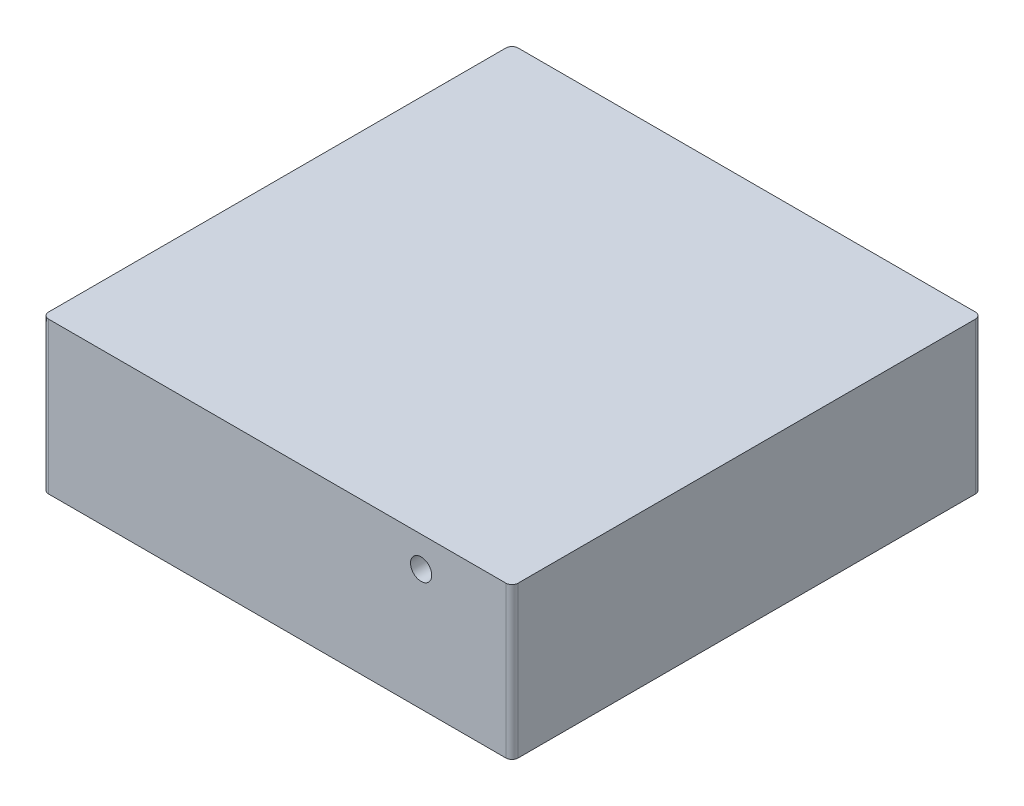
ISO-10303-21;
HEADER;
FILE_DESCRIPTION(('STEP AP214'),'2;1');
FILE_NAME('part.step','',(''),(''),'','','');
FILE_SCHEMA(('AUTOMOTIVE_DESIGN { 1 0 10303 214 1 1 1 1 }'));
ENDSEC;
DATA;
#1=APPLICATION_CONTEXT('core data for automotive mechanical design processes');
#2=APPLICATION_PROTOCOL_DEFINITION('international standard','automotive_design',2000,#1);
#3=PRODUCT_CONTEXT('',#1,'mechanical');
#4=PRODUCT('Part','Part','',(#3));
#5=PRODUCT_RELATED_PRODUCT_CATEGORY('part','',(#4));
#6=PRODUCT_DEFINITION_FORMATION('','',#4);
#7=PRODUCT_DEFINITION_CONTEXT('part definition',#1,'design');
#8=PRODUCT_DEFINITION('design','',#6,#7);
#9=PRODUCT_DEFINITION_SHAPE('','',#8);
#10=(LENGTH_UNIT() NAMED_UNIT(*) SI_UNIT(.MILLI.,.METRE.));
#11=(NAMED_UNIT(*) PLANE_ANGLE_UNIT() SI_UNIT($,.RADIAN.));
#12=(NAMED_UNIT(*) SI_UNIT($,.STERADIAN.) SOLID_ANGLE_UNIT());
#13=UNCERTAINTY_MEASURE_WITH_UNIT(LENGTH_MEASURE(1.E-05),#10,'distance_accuracy_value','');
#14=(GEOMETRIC_REPRESENTATION_CONTEXT(3) GLOBAL_UNCERTAINTY_ASSIGNED_CONTEXT((#13)) GLOBAL_UNIT_ASSIGNED_CONTEXT((#10,
#11,#12)) REPRESENTATION_CONTEXT('',''));
#15=CARTESIAN_POINT('',(0.,0.,0.));
#16=DIRECTION('',(0.,0.,1.));
#17=DIRECTION('',(1.,0.,0.));
#18=AXIS2_PLACEMENT_3D('',#15,#16,#17);
#19=CARTESIAN_POINT('',(10.5,23.,-67.));
#20=DIRECTION('',(0.,-1.,0.));
#21=DIRECTION('',(0.,0.,-1.));
#22=AXIS2_PLACEMENT_3D('',#19,#20,#21);
#23=CYLINDRICAL_SURFACE('',#22,1.);
#24=CARTESIAN_POINT('',(10.5,23.,-67.));
#25=DIRECTION('',(0.,1.,0.));
#26=DIRECTION('',(0.,0.,1.));
#27=AXIS2_PLACEMENT_3D('',#24,#25,#26);
#28=CIRCLE('',#27,1.);
#29=CARTESIAN_POINT('',(10.5,23.,-66.));
#30=VERTEX_POINT('',#29);
#31=EDGE_CURVE('E13',#30,#30,#28,.T.);
#32=ORIENTED_EDGE('',*,*,#31,.F.);
#33=EDGE_LOOP('',(#32));
#34=FACE_BOUND('',#33,.T.);
#35=CARTESIAN_POINT('',(10.5,2.,-67.));
#36=DIRECTION('',(0.,1.,0.));
#37=DIRECTION('',(0.,0.,1.));
#38=AXIS2_PLACEMENT_3D('',#35,#36,#37);
#39=CIRCLE('',#38,1.);
#40=CARTESIAN_POINT('',(10.5,2.,-66.));
#41=VERTEX_POINT('',#40);
#42=EDGE_CURVE('E57',#41,#41,#39,.T.);
#43=ORIENTED_EDGE('',*,*,#42,.T.);
#44=EDGE_LOOP('',(#43));
#45=FACE_BOUND('',#44,.T.);
#46=ADVANCED_FACE('F54',(#34,#45),#23,.T.);
#47=CARTESIAN_POINT('',(10.5,23.,-67.));
#48=DIRECTION('',(0.,1.,0.));
#49=DIRECTION('',(0.,0.,1.));
#50=AXIS2_PLACEMENT_3D('',#47,#48,#49);
#51=PLANE('',#50);
#52=ORIENTED_EDGE('',*,*,#31,.T.);
#53=EDGE_LOOP('',(#52));
#54=FACE_BOUND('',#53,.T.);
#55=ADVANCED_FACE('F69',(#54),#51,.T.);
#56=CARTESIAN_POINT('',(10.5,2.,-67.));
#57=DIRECTION('',(0.,1.,0.));
#58=DIRECTION('',(0.,0.,1.));
#59=AXIS2_PLACEMENT_3D('',#56,#57,#58);
#60=PLANE('',#59);
#61=ORIENTED_EDGE('',*,*,#42,.F.);
#62=EDGE_LOOP('',(#61));
#63=FACE_BOUND('',#62,.T.);
#64=ADVANCED_FACE('F67',(#63),#60,.F.);
#65=CLOSED_SHELL('',(#46,#55,#64));
#66=MANIFOLD_SOLID_BREP('B2',#65);
#67=CARTESIAN_POINT('',(67.,23.,-67.));
#68=DIRECTION('',(0.,-1.,0.));
#69=DIRECTION('',(0.,0.,-1.));
#70=AXIS2_PLACEMENT_3D('',#67,#68,#69);
#71=CYLINDRICAL_SURFACE('',#70,0.999999999999998);
#72=CARTESIAN_POINT('',(67.,23.,-67.));
#73=DIRECTION('',(0.,1.,0.));
#74=DIRECTION('',(0.,0.,1.));
#75=AXIS2_PLACEMENT_3D('',#72,#73,#74);
#76=CIRCLE('',#75,0.999999999999998);
#77=CARTESIAN_POINT('',(67.,23.,-66.));
#78=VERTEX_POINT('',#77);
#79=EDGE_CURVE('E53',#78,#78,#76,.T.);
#80=ORIENTED_EDGE('',*,*,#79,.F.);
#81=EDGE_LOOP('',(#80));
#82=FACE_BOUND('',#81,.T.);
#83=CARTESIAN_POINT('',(67.,2.,-67.));
#84=DIRECTION('',(0.,1.,0.));
#85=DIRECTION('',(0.,0.,1.));
#86=AXIS2_PLACEMENT_3D('',#83,#84,#85);
#87=CIRCLE('',#86,0.999999999999998);
#88=CARTESIAN_POINT('',(67.,2.,-66.));
#89=VERTEX_POINT('',#88);
#90=EDGE_CURVE('E114',#89,#89,#87,.T.);
#91=ORIENTED_EDGE('',*,*,#90,.T.);
#92=EDGE_LOOP('',(#91));
#93=FACE_BOUND('',#92,.T.);
#94=ADVANCED_FACE('F111',(#82,#93),#71,.T.);
#95=CARTESIAN_POINT('',(67.,23.,-67.));
#96=DIRECTION('',(0.,1.,0.));
#97=DIRECTION('',(0.,0.,1.));
#98=AXIS2_PLACEMENT_3D('',#95,#96,#97);
#99=PLANE('',#98);
#100=ORIENTED_EDGE('',*,*,#79,.T.);
#101=EDGE_LOOP('',(#100));
#102=FACE_BOUND('',#101,.T.);
#103=ADVANCED_FACE('F126',(#102),#99,.T.);
#104=CARTESIAN_POINT('',(67.,2.,-67.));
#105=DIRECTION('',(0.,1.,0.));
#106=DIRECTION('',(0.,0.,1.));
#107=AXIS2_PLACEMENT_3D('',#104,#105,#106);
#108=PLANE('',#107);
#109=ORIENTED_EDGE('',*,*,#90,.F.);
#110=EDGE_LOOP('',(#109));
#111=FACE_BOUND('',#110,.T.);
#112=ADVANCED_FACE('F124',(#111),#108,.F.);
#113=CLOSED_SHELL('',(#94,#103,#112));
#114=MANIFOLD_SOLID_BREP('B8',#113);
#115=CARTESIAN_POINT('',(67.,23.,-10.5));
#116=DIRECTION('',(0.,-1.,0.));
#117=DIRECTION('',(0.,0.,-1.));
#118=AXIS2_PLACEMENT_3D('',#115,#116,#117);
#119=CYLINDRICAL_SURFACE('',#118,0.999999999999998);
#120=CARTESIAN_POINT('',(67.,23.,-10.5));
#121=DIRECTION('',(0.,1.,0.));
#122=DIRECTION('',(0.,0.,1.));
#123=AXIS2_PLACEMENT_3D('',#120,#121,#122);
#124=CIRCLE('',#123,0.999999999999998);
#125=CARTESIAN_POINT('',(67.,23.,-9.50000000000001));
#126=VERTEX_POINT('',#125);
#127=EDGE_CURVE('E110',#126,#126,#124,.T.);
#128=ORIENTED_EDGE('',*,*,#127,.F.);
#129=EDGE_LOOP('',(#128));
#130=FACE_BOUND('',#129,.T.);
#131=CARTESIAN_POINT('',(67.,2.,-10.5));
#132=DIRECTION('',(0.,1.,0.));
#133=DIRECTION('',(0.,0.,1.));
#134=AXIS2_PLACEMENT_3D('',#131,#132,#133);
#135=CIRCLE('',#134,0.999999999999998);
#136=CARTESIAN_POINT('',(67.,2.,-9.50000000000001));
#137=VERTEX_POINT('',#136);
#138=EDGE_CURVE('E171',#137,#137,#135,.T.);
#139=ORIENTED_EDGE('',*,*,#138,.T.);
#140=EDGE_LOOP('',(#139));
#141=FACE_BOUND('',#140,.T.);
#142=ADVANCED_FACE('F168',(#130,#141),#119,.T.);
#143=CARTESIAN_POINT('',(67.,23.,-10.5));
#144=DIRECTION('',(0.,1.,0.));
#145=DIRECTION('',(0.,0.,1.));
#146=AXIS2_PLACEMENT_3D('',#143,#144,#145);
#147=PLANE('',#146);
#148=ORIENTED_EDGE('',*,*,#127,.T.);
#149=EDGE_LOOP('',(#148));
#150=FACE_BOUND('',#149,.T.);
#151=ADVANCED_FACE('F183',(#150),#147,.T.);
#152=CARTESIAN_POINT('',(67.,2.,-10.5));
#153=DIRECTION('',(0.,1.,0.));
#154=DIRECTION('',(0.,0.,1.));
#155=AXIS2_PLACEMENT_3D('',#152,#153,#154);
#156=PLANE('',#155);
#157=ORIENTED_EDGE('',*,*,#138,.F.);
#158=EDGE_LOOP('',(#157));
#159=FACE_BOUND('',#158,.T.);
#160=ADVANCED_FACE('F181',(#159),#156,.F.);
#161=CLOSED_SHELL('',(#142,#151,#160));
#162=MANIFOLD_SOLID_BREP('B48',#161);
#163=CARTESIAN_POINT('',(10.5,23.,-10.5));
#164=DIRECTION('',(0.,-1.,0.));
#165=DIRECTION('',(0.,0.,-1.));
#166=AXIS2_PLACEMENT_3D('',#163,#164,#165);
#167=CYLINDRICAL_SURFACE('',#166,1.);
#168=CARTESIAN_POINT('',(10.5,23.,-10.5));
#169=DIRECTION('',(0.,1.,0.));
#170=DIRECTION('',(0.,0.,1.));
#171=AXIS2_PLACEMENT_3D('',#168,#169,#170);
#172=CIRCLE('',#171,1.);
#173=CARTESIAN_POINT('',(10.5,23.,-9.49999999999999));
#174=VERTEX_POINT('',#173);
#175=EDGE_CURVE('E167',#174,#174,#172,.T.);
#176=ORIENTED_EDGE('',*,*,#175,.F.);
#177=EDGE_LOOP('',(#176));
#178=FACE_BOUND('',#177,.T.);
#179=CARTESIAN_POINT('',(10.5,2.,-10.5));
#180=DIRECTION('',(0.,1.,0.));
#181=DIRECTION('',(0.,0.,1.));
#182=AXIS2_PLACEMENT_3D('',#179,#180,#181);
#183=CIRCLE('',#182,1.);
#184=CARTESIAN_POINT('',(10.5,2.,-9.49999999999999));
#185=VERTEX_POINT('',#184);
#186=EDGE_CURVE('E229',#185,#185,#183,.T.);
#187=ORIENTED_EDGE('',*,*,#186,.T.);
#188=EDGE_LOOP('',(#187));
#189=FACE_BOUND('',#188,.T.);
#190=ADVANCED_FACE('F226',(#178,#189),#167,.T.);
#191=CARTESIAN_POINT('',(10.5,23.,-10.5));
#192=DIRECTION('',(0.,1.,0.));
#193=DIRECTION('',(0.,0.,1.));
#194=AXIS2_PLACEMENT_3D('',#191,#192,#193);
#195=PLANE('',#194);
#196=ORIENTED_EDGE('',*,*,#175,.T.);
#197=EDGE_LOOP('',(#196));
#198=FACE_BOUND('',#197,.T.);
#199=ADVANCED_FACE('F241',(#198),#195,.T.);
#200=CARTESIAN_POINT('',(10.5,2.,-10.5));
#201=DIRECTION('',(0.,1.,0.));
#202=DIRECTION('',(0.,0.,1.));
#203=AXIS2_PLACEMENT_3D('',#200,#201,#202);
#204=PLANE('',#203);
#205=ORIENTED_EDGE('',*,*,#186,.F.);
#206=EDGE_LOOP('',(#205));
#207=FACE_BOUND('',#206,.T.);
#208=ADVANCED_FACE('F239',(#207),#204,.F.);
#209=CLOSED_SHELL('',(#190,#199,#208));
#210=MANIFOLD_SOLID_BREP('B105',#209);
#211=CARTESIAN_POINT('',(1.,25.,-76.5));
#212=DIRECTION('',(0.,-1.,0.));
#213=DIRECTION('',(0.,0.,-1.));
#214=AXIS2_PLACEMENT_3D('',#211,#212,#213);
#215=CYLINDRICAL_SURFACE('',#214,1.);
#216=DIRECTION('',(0.,-1.,0.));
#217=VECTOR('',#216,1.);
#218=CARTESIAN_POINT('',(0.,25.,-76.5));
#219=LINE('',#218,#217);
#220=CARTESIAN_POINT('',(0.,25.,-76.5));
#221=VERTEX_POINT('',#220);
#222=CARTESIAN_POINT('',(0.,0.,-76.5));
#223=VERTEX_POINT('',#222);
#224=EDGE_CURVE('E567',#221,#223,#219,.T.);
#225=ORIENTED_EDGE('',*,*,#224,.F.);
#226=CARTESIAN_POINT('',(1.,25.,-76.5));
#227=DIRECTION('',(0.,-1.,0.));
#228=DIRECTION('',(0.,0.,-1.));
#229=AXIS2_PLACEMENT_3D('',#226,#227,#228);
#230=CIRCLE('',#229,1.);
#231=CARTESIAN_POINT('',(1.,25.,-77.5));
#232=VERTEX_POINT('',#231);
#233=EDGE_CURVE('E280',#232,#221,#230,.F.);
#234=ORIENTED_EDGE('',*,*,#233,.F.);
#235=DIRECTION('',(0.,-1.,0.));
#236=VECTOR('',#235,1.);
#237=CARTESIAN_POINT('',(1.,25.,-77.5));
#238=LINE('',#237,#236);
#239=CARTESIAN_POINT('',(1.,0.,-77.5));
#240=VERTEX_POINT('',#239);
#241=EDGE_CURVE('E570',#240,#232,#238,.F.);
#242=ORIENTED_EDGE('',*,*,#241,.F.);
#243=CARTESIAN_POINT('',(1.,0.,-76.5));
#244=DIRECTION('',(0.,-1.,0.));
#245=DIRECTION('',(0.,0.,-1.));
#246=AXIS2_PLACEMENT_3D('',#243,#244,#245);
#247=CIRCLE('',#246,1.);
#248=EDGE_CURVE('E224',#223,#240,#247,.T.);
#249=ORIENTED_EDGE('',*,*,#248,.F.);
#250=EDGE_LOOP('',(#225,#234,#242,#249));
#251=FACE_BOUND('',#250,.T.);
#252=ADVANCED_FACE('F273',(#251),#215,.T.);
#253=CARTESIAN_POINT('',(1.,25.,-1.));
#254=DIRECTION('',(0.,-1.,0.));
#255=DIRECTION('',(0.,0.,-1.));
#256=AXIS2_PLACEMENT_3D('',#253,#254,#255);
#257=CYLINDRICAL_SURFACE('',#256,1.);
#258=DIRECTION('',(0.,-1.,0.));
#259=VECTOR('',#258,1.);
#260=CARTESIAN_POINT('',(1.,25.,0.));
#261=LINE('',#260,#259);
#262=CARTESIAN_POINT('',(1.,25.,0.));
#263=VERTEX_POINT('',#262);
#264=CARTESIAN_POINT('',(1.,0.,0.));
#265=VERTEX_POINT('',#264);
#266=EDGE_CURVE('E556',#263,#265,#261,.T.);
#267=ORIENTED_EDGE('',*,*,#266,.F.);
#268=CARTESIAN_POINT('',(1.,25.,-1.));
#269=DIRECTION('',(0.,-1.,0.));
#270=DIRECTION('',(0.,0.,-1.));
#271=AXIS2_PLACEMENT_3D('',#268,#269,#270);
#272=CIRCLE('',#271,1.);
#273=CARTESIAN_POINT('',(0.,25.,-1.));
#274=VERTEX_POINT('',#273);
#275=EDGE_CURVE('E562',#274,#263,#272,.F.);
#276=ORIENTED_EDGE('',*,*,#275,.F.);
#277=DIRECTION('',(0.,-1.,0.));
#278=VECTOR('',#277,1.);
#279=CARTESIAN_POINT('',(0.,25.,-1.));
#280=LINE('',#279,#278);
#281=CARTESIAN_POINT('',(0.,0.,-1.));
#282=VERTEX_POINT('',#281);
#283=EDGE_CURVE('E559',#282,#274,#280,.F.);
#284=ORIENTED_EDGE('',*,*,#283,.F.);
#285=CARTESIAN_POINT('',(1.,0.,-1.));
#286=DIRECTION('',(0.,-1.,0.));
#287=DIRECTION('',(0.,0.,-1.));
#288=AXIS2_PLACEMENT_3D('',#285,#286,#287);
#289=CIRCLE('',#288,1.);
#290=EDGE_CURVE('E564',#265,#282,#289,.T.);
#291=ORIENTED_EDGE('',*,*,#290,.F.);
#292=EDGE_LOOP('',(#267,#276,#284,#291));
#293=FACE_BOUND('',#292,.T.);
#294=ADVANCED_FACE('F581',(#293),#257,.T.);
#295=CARTESIAN_POINT('',(76.5,25.,-1.));
#296=DIRECTION('',(0.,-1.,0.));
#297=DIRECTION('',(0.,0.,-1.));
#298=AXIS2_PLACEMENT_3D('',#295,#296,#297);
#299=CYLINDRICAL_SURFACE('',#298,1.);
#300=DIRECTION('',(0.,-1.,0.));
#301=VECTOR('',#300,1.);
#302=CARTESIAN_POINT('',(77.5,25.,-1.));
#303=LINE('',#302,#301);
#304=CARTESIAN_POINT('',(77.5,25.,-1.));
#305=VERTEX_POINT('',#304);
#306=CARTESIAN_POINT('',(77.5,0.,-1.));
#307=VERTEX_POINT('',#306);
#308=EDGE_CURVE('E545',#305,#307,#303,.T.);
#309=ORIENTED_EDGE('',*,*,#308,.F.);
#310=CARTESIAN_POINT('',(76.5,25.,-1.));
#311=DIRECTION('',(0.,-1.,0.));
#312=DIRECTION('',(0.,0.,-1.));
#313=AXIS2_PLACEMENT_3D('',#310,#311,#312);
#314=CIRCLE('',#313,1.);
#315=CARTESIAN_POINT('',(76.5,25.,0.));
#316=VERTEX_POINT('',#315);
#317=EDGE_CURVE('E551',#316,#305,#314,.F.);
#318=ORIENTED_EDGE('',*,*,#317,.F.);
#319=DIRECTION('',(0.,-1.,0.));
#320=VECTOR('',#319,1.);
#321=CARTESIAN_POINT('',(76.5,25.,0.));
#322=LINE('',#321,#320);
#323=CARTESIAN_POINT('',(76.5,0.,0.));
#324=VERTEX_POINT('',#323);
#325=EDGE_CURVE('E548',#324,#316,#322,.F.);
#326=ORIENTED_EDGE('',*,*,#325,.F.);
#327=CARTESIAN_POINT('',(76.5,0.,-1.));
#328=DIRECTION('',(0.,-1.,0.));
#329=DIRECTION('',(0.,0.,-1.));
#330=AXIS2_PLACEMENT_3D('',#327,#328,#329);
#331=CIRCLE('',#330,1.);
#332=EDGE_CURVE('E553',#307,#324,#331,.T.);
#333=ORIENTED_EDGE('',*,*,#332,.F.);
#334=EDGE_LOOP('',(#309,#318,#326,#333));
#335=FACE_BOUND('',#334,.T.);
#336=ADVANCED_FACE('F588',(#335),#299,.T.);
#337=CARTESIAN_POINT('',(76.5,25.,-76.5));
#338=DIRECTION('',(0.,-1.,0.));
#339=DIRECTION('',(0.,0.,-1.));
#340=AXIS2_PLACEMENT_3D('',#337,#338,#339);
#341=CYLINDRICAL_SURFACE('',#340,1.);
#342=DIRECTION('',(0.,-1.,0.));
#343=VECTOR('',#342,1.);
#344=CARTESIAN_POINT('',(76.5,25.,-77.5));
#345=LINE('',#344,#343);
#346=CARTESIAN_POINT('',(76.5,25.,-77.5));
#347=VERTEX_POINT('',#346);
#348=CARTESIAN_POINT('',(76.5,0.,-77.5));
#349=VERTEX_POINT('',#348);
#350=EDGE_CURVE('E524',#347,#349,#345,.T.);
#351=ORIENTED_EDGE('',*,*,#350,.F.);
#352=CARTESIAN_POINT('',(76.5,25.,-76.5));
#353=DIRECTION('',(0.,-1.,0.));
#354=DIRECTION('',(0.,0.,-1.));
#355=AXIS2_PLACEMENT_3D('',#352,#353,#354);
#356=CIRCLE('',#355,1.);
#357=CARTESIAN_POINT('',(77.5,25.,-76.5));
#358=VERTEX_POINT('',#357);
#359=EDGE_CURVE('E540',#358,#347,#356,.F.);
#360=ORIENTED_EDGE('',*,*,#359,.F.);
#361=DIRECTION('',(0.,-1.,0.));
#362=VECTOR('',#361,1.);
#363=CARTESIAN_POINT('',(77.5,25.,-76.5));
#364=LINE('',#363,#362);
#365=CARTESIAN_POINT('',(77.5,0.,-76.5));
#366=VERTEX_POINT('',#365);
#367=EDGE_CURVE('E537',#366,#358,#364,.F.);
#368=ORIENTED_EDGE('',*,*,#367,.F.);
#369=CARTESIAN_POINT('',(76.5,0.,-76.5));
#370=DIRECTION('',(0.,-1.,0.));
#371=DIRECTION('',(0.,0.,-1.));
#372=AXIS2_PLACEMENT_3D('',#369,#370,#371);
#373=CIRCLE('',#372,1.);
#374=EDGE_CURVE('E542',#349,#366,#373,.T.);
#375=ORIENTED_EDGE('',*,*,#374,.F.);
#376=EDGE_LOOP('',(#351,#360,#368,#375));
#377=FACE_BOUND('',#376,.T.);
#378=ADVANCED_FACE('F601',(#377),#341,.T.);
#379=CARTESIAN_POINT('',(0.,0.,0.));
#380=DIRECTION('',(0.,-1.,0.));
#381=DIRECTION('',(0.,0.,-1.));
#382=AXIS2_PLACEMENT_3D('',#379,#380,#381);
#383=PLANE('',#382);
#384=DIRECTION('',(0.,0.,1.));
#385=VECTOR('',#384,1.);
#386=CARTESIAN_POINT('',(0.,0.,0.));
#387=LINE('',#386,#385);
#388=EDGE_CURVE('E513',#223,#282,#387,.T.);
#389=ORIENTED_EDGE('',*,*,#388,.F.);
#390=ORIENTED_EDGE('',*,*,#248,.T.);
#391=DIRECTION('',(-1.,0.,0.));
#392=VECTOR('',#391,1.);
#393=CARTESIAN_POINT('',(0.,0.,-77.5));
#394=LINE('',#393,#392);
#395=EDGE_CURVE('E517',#349,#240,#394,.T.);
#396=ORIENTED_EDGE('',*,*,#395,.F.);
#397=ORIENTED_EDGE('',*,*,#374,.T.);
#398=DIRECTION('',(0.,0.,-1.));
#399=VECTOR('',#398,1.);
#400=CARTESIAN_POINT('',(77.5,0.,0.));
#401=LINE('',#400,#399);
#402=EDGE_CURVE('E528',#307,#366,#401,.T.);
#403=ORIENTED_EDGE('',*,*,#402,.F.);
#404=ORIENTED_EDGE('',*,*,#332,.T.);
#405=DIRECTION('',(1.,0.,0.));
#406=VECTOR('',#405,1.);
#407=CARTESIAN_POINT('',(0.,0.,0.));
#408=LINE('',#407,#406);
#409=EDGE_CURVE('E526',#265,#324,#408,.T.);
#410=ORIENTED_EDGE('',*,*,#409,.F.);
#411=ORIENTED_EDGE('',*,*,#290,.T.);
#412=EDGE_LOOP('',(#389,#390,#396,#397,#403,#404,#410,#411));
#413=FACE_BOUND('',#412,.T.);
#414=DIRECTION('',(-1.,0.,0.));
#415=VECTOR('',#414,1.);
#416=CARTESIAN_POINT('',(1.,0.,-76.5));
#417=LINE('',#416,#415);
#418=CARTESIAN_POINT('',(76.5,0.,-76.5));
#419=VERTEX_POINT('',#418);
#420=CARTESIAN_POINT('',(1.,0.,-76.5));
#421=VERTEX_POINT('',#420);
#422=EDGE_CURVE('E456',#419,#421,#417,.T.);
#423=ORIENTED_EDGE('',*,*,#422,.T.);
#424=DIRECTION('',(0.,0.,1.));
#425=VECTOR('',#424,1.);
#426=CARTESIAN_POINT('',(1.,0.,-1.));
#427=LINE('',#426,#425);
#428=CARTESIAN_POINT('',(1.,0.,-1.));
#429=VERTEX_POINT('',#428);
#430=EDGE_CURVE('E427',#421,#429,#427,.T.);
#431=ORIENTED_EDGE('',*,*,#430,.T.);
#432=DIRECTION('',(1.,0.,0.));
#433=VECTOR('',#432,1.);
#434=CARTESIAN_POINT('',(1.,0.,-1.));
#435=LINE('',#434,#433);
#436=CARTESIAN_POINT('',(76.5,0.,-1.));
#437=VERTEX_POINT('',#436);
#438=EDGE_CURVE('E465',#429,#437,#435,.T.);
#439=ORIENTED_EDGE('',*,*,#438,.T.);
#440=DIRECTION('',(0.,0.,-1.));
#441=VECTOR('',#440,1.);
#442=CARTESIAN_POINT('',(76.5,0.,-1.));
#443=LINE('',#442,#441);
#444=EDGE_CURVE('E468',#437,#419,#443,.T.);
#445=ORIENTED_EDGE('',*,*,#444,.T.);
#446=EDGE_LOOP('',(#423,#431,#439,#445));
#447=FACE_BOUND('',#446,.T.);
#448=ADVANCED_FACE('F593',(#413,#447),#383,.T.);
#449=CARTESIAN_POINT('',(0.,25.,0.));
#450=DIRECTION('',(1.,0.,0.));
#451=DIRECTION('',(0.,0.,-1.));
#452=AXIS2_PLACEMENT_3D('',#449,#450,#451);
#453=PLANE('',#452);
#454=CARTESIAN_POINT('',(0.,20.,-62.5));
#455=DIRECTION('',(1.,0.,0.));
#456=DIRECTION('',(0.,0.,-1.));
#457=AXIS2_PLACEMENT_3D('',#454,#455,#456);
#458=CIRCLE('',#457,2.);
#459=CARTESIAN_POINT('',(0.,20.,-64.5));
#460=VERTEX_POINT('',#459);
#461=EDGE_CURVE('E636',#460,#460,#458,.T.);
#462=ORIENTED_EDGE('',*,*,#461,.T.);
#463=EDGE_LOOP('',(#462));
#464=FACE_BOUND('',#463,.T.);
#465=DIRECTION('',(0.,0.,1.));
#466=VECTOR('',#465,1.);
#467=CARTESIAN_POINT('',(0.,25.,0.));
#468=LINE('',#467,#466);
#469=EDGE_CURVE('E514',#221,#274,#468,.T.);
#470=ORIENTED_EDGE('',*,*,#469,.F.);
#471=ORIENTED_EDGE('',*,*,#224,.T.);
#472=ORIENTED_EDGE('',*,*,#388,.T.);
#473=ORIENTED_EDGE('',*,*,#283,.T.);
#474=EDGE_LOOP('',(#470,#471,#472,#473));
#475=FACE_BOUND('',#474,.T.);
#476=ADVANCED_FACE('F577',(#464,#475),#453,.F.);
#477=CARTESIAN_POINT('',(0.,25.,0.));
#478=DIRECTION('',(0.,0.,-1.));
#479=DIRECTION('',(-1.,0.,0.));
#480=AXIS2_PLACEMENT_3D('',#477,#478,#479);
#481=PLANE('',#480);
#482=CARTESIAN_POINT('',(62.5,20.,0.));
#483=DIRECTION('',(0.,0.,1.));
#484=DIRECTION('',(1.,0.,0.));
#485=AXIS2_PLACEMENT_3D('',#482,#483,#484);
#486=CIRCLE('',#485,1.75);
#487=CARTESIAN_POINT('',(64.25,20.,0.));
#488=VERTEX_POINT('',#487);
#489=EDGE_CURVE('E534',#488,#488,#486,.T.);
#490=ORIENTED_EDGE('',*,*,#489,.F.);
#491=EDGE_LOOP('',(#490));
#492=FACE_BOUND('',#491,.T.);
#493=DIRECTION('',(1.,0.,0.));
#494=VECTOR('',#493,1.);
#495=CARTESIAN_POINT('',(0.,25.,0.));
#496=LINE('',#495,#494);
#497=EDGE_CURVE('E516',#263,#316,#496,.T.);
#498=ORIENTED_EDGE('',*,*,#497,.F.);
#499=ORIENTED_EDGE('',*,*,#266,.T.);
#500=ORIENTED_EDGE('',*,*,#409,.T.);
#501=ORIENTED_EDGE('',*,*,#325,.T.);
#502=EDGE_LOOP('',(#498,#499,#500,#501));
#503=FACE_BOUND('',#502,.T.);
#504=ADVANCED_FACE('F590',(#492,#503),#481,.F.);
#505=CARTESIAN_POINT('',(77.5,25.,0.));
#506=DIRECTION('',(-1.,0.,0.));
#507=DIRECTION('',(0.,0.,1.));
#508=AXIS2_PLACEMENT_3D('',#505,#506,#507);
#509=PLANE('',#508);
#510=DIRECTION('',(0.,0.,-1.));
#511=VECTOR('',#510,1.);
#512=CARTESIAN_POINT('',(77.5,25.,0.));
#513=LINE('',#512,#511);
#514=EDGE_CURVE('E519',#305,#358,#513,.T.);
#515=ORIENTED_EDGE('',*,*,#514,.F.);
#516=ORIENTED_EDGE('',*,*,#308,.T.);
#517=ORIENTED_EDGE('',*,*,#402,.T.);
#518=ORIENTED_EDGE('',*,*,#367,.T.);
#519=EDGE_LOOP('',(#515,#516,#517,#518));
#520=FACE_BOUND('',#519,.T.);
#521=ADVANCED_FACE('F596',(#520),#509,.F.);
#522=CARTESIAN_POINT('',(0.,25.,-77.5));
#523=DIRECTION('',(0.,0.,1.));
#524=DIRECTION('',(1.,0.,0.));
#525=AXIS2_PLACEMENT_3D('',#522,#523,#524);
#526=PLANE('',#525);
#527=ORIENTED_EDGE('',*,*,#395,.T.);
#528=ORIENTED_EDGE('',*,*,#241,.T.);
#529=DIRECTION('',(-1.,0.,0.));
#530=VECTOR('',#529,1.);
#531=CARTESIAN_POINT('',(0.,25.,-77.5));
#532=LINE('',#531,#530);
#533=EDGE_CURVE('E521',#347,#232,#532,.T.);
#534=ORIENTED_EDGE('',*,*,#533,.F.);
#535=ORIENTED_EDGE('',*,*,#350,.T.);
#536=EDGE_LOOP('',(#527,#528,#534,#535));
#537=FACE_BOUND('',#536,.T.);
#538=ADVANCED_FACE('F603',(#537),#526,.F.);
#539=CARTESIAN_POINT('',(0.,25.,0.));
#540=DIRECTION('',(0.,-1.,0.));
#541=DIRECTION('',(0.,0.,-1.));
#542=AXIS2_PLACEMENT_3D('',#539,#540,#541);
#543=PLANE('',#542);
#544=ORIENTED_EDGE('',*,*,#533,.T.);
#545=ORIENTED_EDGE('',*,*,#233,.T.);
#546=ORIENTED_EDGE('',*,*,#469,.T.);
#547=ORIENTED_EDGE('',*,*,#275,.T.);
#548=ORIENTED_EDGE('',*,*,#497,.T.);
#549=ORIENTED_EDGE('',*,*,#317,.T.);
#550=ORIENTED_EDGE('',*,*,#514,.T.);
#551=ORIENTED_EDGE('',*,*,#359,.T.);
#552=EDGE_LOOP('',(#544,#545,#546,#547,#548,#549,#550,#551));
#553=FACE_BOUND('',#552,.T.);
#554=ADVANCED_FACE('F572',(#553),#543,.F.);
#555=CARTESIAN_POINT('',(0.,3.99999999999999,0.));
#556=DIRECTION('',(0.,-1.,0.));
#557=DIRECTION('',(0.,0.,-1.));
#558=AXIS2_PLACEMENT_3D('',#555,#556,#557);
#559=PLANE('',#558);
#560=DIRECTION('',(0.,0.,1.));
#561=VECTOR('',#560,1.);
#562=CARTESIAN_POINT('',(1.,3.99999999999999,-1.));
#563=LINE('',#562,#561);
#564=CARTESIAN_POINT('',(1.,3.99999999999999,-76.5));
#565=VERTEX_POINT('',#564);
#566=CARTESIAN_POINT('',(1.,3.99999999999999,-1.));
#567=VERTEX_POINT('',#566);
#568=EDGE_CURVE('E452',#565,#567,#563,.T.);
#569=ORIENTED_EDGE('',*,*,#568,.F.);
#570=DIRECTION('',(-1.,0.,0.));
#571=VECTOR('',#570,1.);
#572=CARTESIAN_POINT('',(1.,3.99999999999999,-76.5));
#573=LINE('',#572,#571);
#574=CARTESIAN_POINT('',(76.5,3.99999999999999,-76.5));
#575=VERTEX_POINT('',#574);
#576=EDGE_CURVE('E460',#575,#565,#573,.T.);
#577=ORIENTED_EDGE('',*,*,#576,.F.);
#578=DIRECTION('',(0.,0.,-1.));
#579=VECTOR('',#578,1.);
#580=CARTESIAN_POINT('',(76.5,3.99999999999999,-1.));
#581=LINE('',#580,#579);
#582=CARTESIAN_POINT('',(76.5,3.99999999999999,-1.));
#583=VERTEX_POINT('',#582);
#584=EDGE_CURVE('E458',#583,#575,#581,.T.);
#585=ORIENTED_EDGE('',*,*,#584,.F.);
#586=DIRECTION('',(1.,0.,0.));
#587=VECTOR('',#586,1.);
#588=CARTESIAN_POINT('',(1.,3.99999999999999,-1.));
#589=LINE('',#588,#587);
#590=EDGE_CURVE('E455',#567,#583,#589,.T.);
#591=ORIENTED_EDGE('',*,*,#590,.F.);
#592=EDGE_LOOP('',(#569,#577,#585,#591));
#593=FACE_BOUND('',#592,.T.);
#594=DIRECTION('',(0.,0.,1.));
#595=VECTOR('',#594,1.);
#596=CARTESIAN_POINT('',(2.5,3.99999999999999,-2.5));
#597=LINE('',#596,#595);
#598=CARTESIAN_POINT('',(2.5,3.99999999999999,-75.));
#599=VERTEX_POINT('',#598);
#600=CARTESIAN_POINT('',(2.5,3.99999999999999,-2.5));
#601=VERTEX_POINT('',#600);
#602=EDGE_CURVE('E406',#599,#601,#597,.T.);
#603=ORIENTED_EDGE('',*,*,#602,.T.);
#604=DIRECTION('',(1.,0.,0.));
#605=VECTOR('',#604,1.);
#606=CARTESIAN_POINT('',(2.5,3.99999999999999,-2.5));
#607=LINE('',#606,#605);
#608=CARTESIAN_POINT('',(75.,3.99999999999999,-2.5));
#609=VERTEX_POINT('',#608);
#610=EDGE_CURVE('E411',#601,#609,#607,.T.);
#611=ORIENTED_EDGE('',*,*,#610,.T.);
#612=DIRECTION('',(0.,0.,-1.));
#613=VECTOR('',#612,1.);
#614=CARTESIAN_POINT('',(75.,3.99999999999999,-2.5));
#615=LINE('',#614,#613);
#616=CARTESIAN_POINT('',(75.,3.99999999999999,-75.));
#617=VERTEX_POINT('',#616);
#618=EDGE_CURVE('E432',#609,#617,#615,.T.);
#619=ORIENTED_EDGE('',*,*,#618,.T.);
#620=DIRECTION('',(-1.,0.,0.));
#621=VECTOR('',#620,1.);
#622=CARTESIAN_POINT('',(2.5,3.99999999999999,-75.));
#623=LINE('',#622,#621);
#624=EDGE_CURVE('E414',#617,#599,#623,.T.);
#625=ORIENTED_EDGE('',*,*,#624,.T.);
#626=EDGE_LOOP('',(#603,#611,#619,#625));
#627=FACE_BOUND('',#626,.T.);
#628=ADVANCED_FACE('F408',(#593,#627),#559,.T.);
#629=CARTESIAN_POINT('',(1.,3.99999999999999,-1.));
#630=DIRECTION('',(1.,0.,0.));
#631=DIRECTION('',(0.,0.,-1.));
#632=AXIS2_PLACEMENT_3D('',#629,#630,#631);
#633=PLANE('',#632);
#634=ORIENTED_EDGE('',*,*,#430,.F.);
#635=DIRECTION('',(0.,-1.,0.));
#636=VECTOR('',#635,1.);
#637=CARTESIAN_POINT('',(1.,3.99999999999999,-76.5));
#638=LINE('',#637,#636);
#639=EDGE_CURVE('E462',#565,#421,#638,.T.);
#640=ORIENTED_EDGE('',*,*,#639,.F.);
#641=ORIENTED_EDGE('',*,*,#568,.T.);
#642=DIRECTION('',(0.,-1.,0.));
#643=VECTOR('',#642,1.);
#644=CARTESIAN_POINT('',(1.,3.99999999999999,-1.));
#645=LINE('',#644,#643);
#646=EDGE_CURVE('E479',#567,#429,#645,.T.);
#647=ORIENTED_EDGE('',*,*,#646,.T.);
#648=EDGE_LOOP('',(#634,#640,#641,#647));
#649=FACE_BOUND('',#648,.T.);
#650=ADVANCED_FACE('F670',(#649),#633,.T.);
#651=CARTESIAN_POINT('',(1.,3.99999999999999,-1.));
#652=DIRECTION('',(0.,0.,-1.));
#653=DIRECTION('',(-1.,0.,0.));
#654=AXIS2_PLACEMENT_3D('',#651,#652,#653);
#655=PLANE('',#654);
#656=ORIENTED_EDGE('',*,*,#438,.F.);
#657=ORIENTED_EDGE('',*,*,#646,.F.);
#658=ORIENTED_EDGE('',*,*,#590,.T.);
#659=DIRECTION('',(0.,-1.,0.));
#660=VECTOR('',#659,1.);
#661=CARTESIAN_POINT('',(76.5,3.99999999999999,-1.));
#662=LINE('',#661,#660);
#663=EDGE_CURVE('E477',#583,#437,#662,.T.);
#664=ORIENTED_EDGE('',*,*,#663,.T.);
#665=EDGE_LOOP('',(#656,#657,#658,#664));
#666=FACE_BOUND('',#665,.T.);
#667=ADVANCED_FACE('F678',(#666),#655,.T.);
#668=CARTESIAN_POINT('',(76.5,3.99999999999999,-1.));
#669=DIRECTION('',(-1.,0.,0.));
#670=DIRECTION('',(0.,0.,1.));
#671=AXIS2_PLACEMENT_3D('',#668,#669,#670);
#672=PLANE('',#671);
#673=ORIENTED_EDGE('',*,*,#444,.F.);
#674=ORIENTED_EDGE('',*,*,#663,.F.);
#675=ORIENTED_EDGE('',*,*,#584,.T.);
#676=DIRECTION('',(0.,-1.,0.));
#677=VECTOR('',#676,1.);
#678=CARTESIAN_POINT('',(76.5,3.99999999999999,-76.5));
#679=LINE('',#678,#677);
#680=EDGE_CURVE('E475',#575,#419,#679,.T.);
#681=ORIENTED_EDGE('',*,*,#680,.T.);
#682=EDGE_LOOP('',(#673,#674,#675,#681));
#683=FACE_BOUND('',#682,.T.);
#684=ADVANCED_FACE('F674',(#683),#672,.T.);
#685=CARTESIAN_POINT('',(1.,3.99999999999999,-76.5));
#686=DIRECTION('',(0.,0.,1.));
#687=DIRECTION('',(1.,0.,0.));
#688=AXIS2_PLACEMENT_3D('',#685,#686,#687);
#689=PLANE('',#688);
#690=ORIENTED_EDGE('',*,*,#422,.F.);
#691=ORIENTED_EDGE('',*,*,#680,.F.);
#692=ORIENTED_EDGE('',*,*,#576,.T.);
#693=ORIENTED_EDGE('',*,*,#639,.T.);
#694=EDGE_LOOP('',(#690,#691,#692,#693));
#695=FACE_BOUND('',#694,.T.);
#696=ADVANCED_FACE('F667',(#695),#689,.T.);
#697=CARTESIAN_POINT('',(2.5,3.99999999999999,-2.5));
#698=DIRECTION('',(1.,0.,0.));
#699=DIRECTION('',(0.,0.,-1.));
#700=AXIS2_PLACEMENT_3D('',#697,#698,#699);
#701=PLANE('',#700);
#702=DIRECTION('',(0.,0.,1.));
#703=VECTOR('',#702,1.);
#704=CARTESIAN_POINT('',(2.5,0.,-2.5));
#705=LINE('',#704,#703);
#706=CARTESIAN_POINT('',(2.5,0.,-75.));
#707=VERTEX_POINT('',#706);
#708=CARTESIAN_POINT('',(2.5,0.,-2.5));
#709=VERTEX_POINT('',#708);
#710=EDGE_CURVE('E423',#707,#709,#705,.T.);
#711=ORIENTED_EDGE('',*,*,#710,.T.);
#712=DIRECTION('',(0.,-1.,0.));
#713=VECTOR('',#712,1.);
#714=CARTESIAN_POINT('',(2.5,3.99999999999999,-2.5));
#715=LINE('',#714,#713);
#716=EDGE_CURVE('E420',#601,#709,#715,.T.);
#717=ORIENTED_EDGE('',*,*,#716,.F.);
#718=ORIENTED_EDGE('',*,*,#602,.F.);
#719=DIRECTION('',(0.,-1.,0.));
#720=VECTOR('',#719,1.);
#721=CARTESIAN_POINT('',(2.5,3.99999999999999,-75.));
#722=LINE('',#721,#720);
#723=EDGE_CURVE('E438',#599,#707,#722,.T.);
#724=ORIENTED_EDGE('',*,*,#723,.T.);
#725=EDGE_LOOP('',(#711,#717,#718,#724));
#726=FACE_BOUND('',#725,.T.);
#727=ADVANCED_FACE('F421',(#726),#701,.F.);
#728=CARTESIAN_POINT('',(2.5,3.99999999999999,-2.5));
#729=DIRECTION('',(0.,0.,-1.));
#730=DIRECTION('',(-1.,0.,0.));
#731=AXIS2_PLACEMENT_3D('',#728,#729,#730);
#732=PLANE('',#731);
#733=DIRECTION('',(1.,0.,0.));
#734=VECTOR('',#733,1.);
#735=CARTESIAN_POINT('',(2.5,0.,-2.5));
#736=LINE('',#735,#734);
#737=CARTESIAN_POINT('',(75.,0.,-2.5));
#738=VERTEX_POINT('',#737);
#739=EDGE_CURVE('E440',#709,#738,#736,.T.);
#740=ORIENTED_EDGE('',*,*,#739,.T.);
#741=DIRECTION('',(0.,-1.,0.));
#742=VECTOR('',#741,1.);
#743=CARTESIAN_POINT('',(75.,3.99999999999999,-2.5));
#744=LINE('',#743,#742);
#745=EDGE_CURVE('E428',#609,#738,#744,.T.);
#746=ORIENTED_EDGE('',*,*,#745,.F.);
#747=ORIENTED_EDGE('',*,*,#610,.F.);
#748=ORIENTED_EDGE('',*,*,#716,.T.);
#749=EDGE_LOOP('',(#740,#746,#747,#748));
#750=FACE_BOUND('',#749,.T.);
#751=ADVANCED_FACE('F430',(#750),#732,.F.);
#752=CARTESIAN_POINT('',(75.,3.99999999999999,-2.5));
#753=DIRECTION('',(-1.,0.,0.));
#754=DIRECTION('',(0.,0.,1.));
#755=AXIS2_PLACEMENT_3D('',#752,#753,#754);
#756=PLANE('',#755);
#757=DIRECTION('',(0.,0.,-1.));
#758=VECTOR('',#757,1.);
#759=CARTESIAN_POINT('',(75.,0.,-2.5));
#760=LINE('',#759,#758);
#761=CARTESIAN_POINT('',(75.,0.,-75.));
#762=VERTEX_POINT('',#761);
#763=EDGE_CURVE('E443',#738,#762,#760,.T.);
#764=ORIENTED_EDGE('',*,*,#763,.T.);
#765=DIRECTION('',(0.,-1.,0.));
#766=VECTOR('',#765,1.);
#767=CARTESIAN_POINT('',(75.,3.99999999999999,-75.));
#768=LINE('',#767,#766);
#769=EDGE_CURVE('E448',#617,#762,#768,.T.);
#770=ORIENTED_EDGE('',*,*,#769,.F.);
#771=ORIENTED_EDGE('',*,*,#618,.F.);
#772=ORIENTED_EDGE('',*,*,#745,.T.);
#773=EDGE_LOOP('',(#764,#770,#771,#772));
#774=FACE_BOUND('',#773,.T.);
#775=ADVANCED_FACE('F658',(#774),#756,.F.);
#776=CARTESIAN_POINT('',(2.5,3.99999999999999,-75.));
#777=DIRECTION('',(0.,0.,1.));
#778=DIRECTION('',(1.,0.,0.));
#779=AXIS2_PLACEMENT_3D('',#776,#777,#778);
#780=PLANE('',#779);
#781=DIRECTION('',(-1.,0.,0.));
#782=VECTOR('',#781,1.);
#783=CARTESIAN_POINT('',(2.5,0.,-75.));
#784=LINE('',#783,#782);
#785=EDGE_CURVE('E417',#762,#707,#784,.T.);
#786=ORIENTED_EDGE('',*,*,#785,.T.);
#787=ORIENTED_EDGE('',*,*,#723,.F.);
#788=ORIENTED_EDGE('',*,*,#624,.F.);
#789=ORIENTED_EDGE('',*,*,#769,.T.);
#790=EDGE_LOOP('',(#786,#787,#788,#789));
#791=FACE_BOUND('',#790,.T.);
#792=ADVANCED_FACE('F654',(#791),#780,.F.);
#793=CARTESIAN_POINT('',(0.,23.,0.));
#794=DIRECTION('',(0.,-1.,0.));
#795=DIRECTION('',(0.,0.,-1.));
#796=AXIS2_PLACEMENT_3D('',#793,#794,#795);
#797=PLANE('',#796);
#798=DIRECTION('',(0.,0.,1.));
#799=VECTOR('',#798,1.);
#800=CARTESIAN_POINT('',(3.5,23.,-3.5));
#801=LINE('',#800,#799);
#802=CARTESIAN_POINT('',(3.5,23.,-74.));
#803=VERTEX_POINT('',#802);
#804=CARTESIAN_POINT('',(3.5,23.,-3.5));
#805=VERTEX_POINT('',#804);
#806=EDGE_CURVE('E483',#803,#805,#801,.T.);
#807=ORIENTED_EDGE('',*,*,#806,.F.);
#808=DIRECTION('',(-1.,0.,0.));
#809=VECTOR('',#808,1.);
#810=CARTESIAN_POINT('',(3.5,23.,-74.));
#811=LINE('',#810,#809);
#812=CARTESIAN_POINT('',(74.,23.,-74.));
#813=VERTEX_POINT('',#812);
#814=EDGE_CURVE('E491',#813,#803,#811,.T.);
#815=ORIENTED_EDGE('',*,*,#814,.F.);
#816=DIRECTION('',(0.,0.,-1.));
#817=VECTOR('',#816,1.);
#818=CARTESIAN_POINT('',(74.,23.,-3.5));
#819=LINE('',#818,#817);
#820=CARTESIAN_POINT('',(74.,23.,-3.5));
#821=VERTEX_POINT('',#820);
#822=EDGE_CURVE('E489',#821,#813,#819,.T.);
#823=ORIENTED_EDGE('',*,*,#822,.F.);
#824=DIRECTION('',(1.,0.,0.));
#825=VECTOR('',#824,1.);
#826=CARTESIAN_POINT('',(3.5,23.,-3.5));
#827=LINE('',#826,#825);
#828=EDGE_CURVE('E486',#805,#821,#827,.T.);
#829=ORIENTED_EDGE('',*,*,#828,.F.);
#830=EDGE_LOOP('',(#807,#815,#823,#829));
#831=FACE_BOUND('',#830,.T.);
#832=ADVANCED_FACE('F657',(#831),#797,.T.);
#833=CARTESIAN_POINT('',(74.,23.,-3.5));
#834=DIRECTION('',(-1.,0.,0.));
#835=DIRECTION('',(0.,0.,1.));
#836=AXIS2_PLACEMENT_3D('',#833,#834,#835);
#837=PLANE('',#836);
#838=DIRECTION('',(0.,0.,-1.));
#839=VECTOR('',#838,1.);
#840=CARTESIAN_POINT('',(74.,0.,-3.5));
#841=LINE('',#840,#839);
#842=CARTESIAN_POINT('',(74.,0.,-3.5));
#843=VERTEX_POINT('',#842);
#844=CARTESIAN_POINT('',(74.,0.,-74.));
#845=VERTEX_POINT('',#844);
#846=EDGE_CURVE('E499',#843,#845,#841,.T.);
#847=ORIENTED_EDGE('',*,*,#846,.F.);
#848=DIRECTION('',(0.,-1.,0.));
#849=VECTOR('',#848,1.);
#850=CARTESIAN_POINT('',(74.,23.,-3.5));
#851=LINE('',#850,#849);
#852=EDGE_CURVE('E508',#821,#843,#851,.T.);
#853=ORIENTED_EDGE('',*,*,#852,.F.);
#854=ORIENTED_EDGE('',*,*,#822,.T.);
#855=DIRECTION('',(0.,-1.,0.));
#856=VECTOR('',#855,1.);
#857=CARTESIAN_POINT('',(74.,23.,-74.));
#858=LINE('',#857,#856);
#859=EDGE_CURVE('E506',#813,#845,#858,.T.);
#860=ORIENTED_EDGE('',*,*,#859,.T.);
#861=EDGE_LOOP('',(#847,#853,#854,#860));
#862=FACE_BOUND('',#861,.T.);
#863=ADVANCED_FACE('F688',(#862),#837,.T.);
#864=CARTESIAN_POINT('',(3.5,23.,-3.5));
#865=DIRECTION('',(0.,0.,-1.));
#866=DIRECTION('',(-1.,0.,0.));
#867=AXIS2_PLACEMENT_3D('',#864,#865,#866);
#868=PLANE('',#867);
#869=CARTESIAN_POINT('',(62.5,20.,-3.5));
#870=DIRECTION('',(0.,0.,-1.));
#871=DIRECTION('',(-1.,0.,0.));
#872=AXIS2_PLACEMENT_3D('',#869,#870,#871);
#873=CIRCLE('',#872,1.75);
#874=CARTESIAN_POINT('',(60.75,20.,-3.5));
#875=VERTEX_POINT('',#874);
#876=EDGE_CURVE('E441',#875,#875,#873,.T.);
#877=ORIENTED_EDGE('',*,*,#876,.F.);
#878=EDGE_LOOP('',(#877));
#879=FACE_BOUND('',#878,.T.);
#880=DIRECTION('',(1.,0.,0.));
#881=VECTOR('',#880,1.);
#882=CARTESIAN_POINT('',(3.5,0.,-3.5));
#883=LINE('',#882,#881);
#884=CARTESIAN_POINT('',(3.5,0.,-3.5));
#885=VERTEX_POINT('',#884);
#886=EDGE_CURVE('E496',#885,#843,#883,.T.);
#887=ORIENTED_EDGE('',*,*,#886,.F.);
#888=DIRECTION('',(0.,-1.,0.));
#889=VECTOR('',#888,1.);
#890=CARTESIAN_POINT('',(3.5,23.,-3.5));
#891=LINE('',#890,#889);
#892=EDGE_CURVE('E510',#805,#885,#891,.T.);
#893=ORIENTED_EDGE('',*,*,#892,.F.);
#894=ORIENTED_EDGE('',*,*,#828,.T.);
#895=ORIENTED_EDGE('',*,*,#852,.T.);
#896=EDGE_LOOP('',(#887,#893,#894,#895));
#897=FACE_BOUND('',#896,.T.);
#898=ADVANCED_FACE('F697',(#879,#897),#868,.T.);
#899=CARTESIAN_POINT('',(3.5,23.,-3.5));
#900=DIRECTION('',(1.,0.,0.));
#901=DIRECTION('',(0.,0.,-1.));
#902=AXIS2_PLACEMENT_3D('',#899,#900,#901);
#903=PLANE('',#902);
#904=CARTESIAN_POINT('',(3.5,20.,-62.5));
#905=DIRECTION('',(1.,0.,0.));
#906=DIRECTION('',(0.,0.,-1.));
#907=AXIS2_PLACEMENT_3D('',#904,#905,#906);
#908=CIRCLE('',#907,2.);
#909=CARTESIAN_POINT('',(3.5,20.,-64.5));
#910=VERTEX_POINT('',#909);
#911=EDGE_CURVE('E634',#910,#910,#908,.T.);
#912=ORIENTED_EDGE('',*,*,#911,.F.);
#913=EDGE_LOOP('',(#912));
#914=FACE_BOUND('',#913,.T.);
#915=DIRECTION('',(0.,0.,1.));
#916=VECTOR('',#915,1.);
#917=CARTESIAN_POINT('',(3.5,0.,-3.5));
#918=LINE('',#917,#916);
#919=CARTESIAN_POINT('',(3.5,0.,-74.));
#920=VERTEX_POINT('',#919);
#921=EDGE_CURVE('E482',#920,#885,#918,.T.);
#922=ORIENTED_EDGE('',*,*,#921,.F.);
#923=DIRECTION('',(0.,-1.,0.));
#924=VECTOR('',#923,1.);
#925=CARTESIAN_POINT('',(3.5,23.,-74.));
#926=LINE('',#925,#924);
#927=EDGE_CURVE('E493',#803,#920,#926,.T.);
#928=ORIENTED_EDGE('',*,*,#927,.F.);
#929=ORIENTED_EDGE('',*,*,#806,.T.);
#930=ORIENTED_EDGE('',*,*,#892,.T.);
#931=EDGE_LOOP('',(#922,#928,#929,#930));
#932=FACE_BOUND('',#931,.T.);
#933=ADVANCED_FACE('F693',(#914,#932),#903,.T.);
#934=CARTESIAN_POINT('',(3.5,23.,-74.));
#935=DIRECTION('',(0.,0.,1.));
#936=DIRECTION('',(1.,0.,0.));
#937=AXIS2_PLACEMENT_3D('',#934,#935,#936);
#938=PLANE('',#937);
#939=DIRECTION('',(-1.,0.,0.));
#940=VECTOR('',#939,1.);
#941=CARTESIAN_POINT('',(3.5,0.,-74.));
#942=LINE('',#941,#940);
#943=EDGE_CURVE('E487',#845,#920,#942,.T.);
#944=ORIENTED_EDGE('',*,*,#943,.F.);
#945=ORIENTED_EDGE('',*,*,#859,.F.);
#946=ORIENTED_EDGE('',*,*,#814,.T.);
#947=ORIENTED_EDGE('',*,*,#927,.T.);
#948=EDGE_LOOP('',(#944,#945,#946,#947));
#949=FACE_BOUND('',#948,.T.);
#950=ADVANCED_FACE('F690',(#949),#938,.T.);
#951=ORIENTED_EDGE('',*,*,#710,.F.);
#952=ORIENTED_EDGE('',*,*,#785,.F.);
#953=ORIENTED_EDGE('',*,*,#763,.F.);
#954=ORIENTED_EDGE('',*,*,#739,.F.);
#955=EDGE_LOOP('',(#951,#952,#953,#954));
#956=FACE_BOUND('',#955,.T.);
#957=ORIENTED_EDGE('',*,*,#943,.T.);
#958=ORIENTED_EDGE('',*,*,#921,.T.);
#959=ORIENTED_EDGE('',*,*,#886,.T.);
#960=ORIENTED_EDGE('',*,*,#846,.T.);
#961=EDGE_LOOP('',(#957,#958,#959,#960));
#962=FACE_BOUND('',#961,.T.);
#963=ADVANCED_FACE('F650',(#956,#962),#383,.T.);
#964=CARTESIAN_POINT('',(62.5,20.,-7.));
#965=DIRECTION('',(0.,0.,1.));
#966=DIRECTION('',(1.,0.,0.));
#967=AXIS2_PLACEMENT_3D('',#964,#965,#966);
#968=CYLINDRICAL_SURFACE('',#967,1.75);
#969=ORIENTED_EDGE('',*,*,#876,.T.);
#970=EDGE_LOOP('',(#969));
#971=FACE_BOUND('',#970,.T.);
#972=ORIENTED_EDGE('',*,*,#489,.T.);
#973=EDGE_LOOP('',(#972));
#974=FACE_BOUND('',#973,.T.);
#975=ADVANCED_FACE('F644',(#971,#974),#968,.F.);
#976=CARTESIAN_POINT('',(3.5,20.,-62.5));
#977=DIRECTION('',(-1.,0.,0.));
#978=DIRECTION('',(0.,0.,1.));
#979=AXIS2_PLACEMENT_3D('',#976,#977,#978);
#980=CYLINDRICAL_SURFACE('',#979,2.);
#981=ORIENTED_EDGE('',*,*,#911,.T.);
#982=EDGE_LOOP('',(#981));
#983=FACE_BOUND('',#982,.T.);
#984=ORIENTED_EDGE('',*,*,#461,.F.);
#985=EDGE_LOOP('',(#984));
#986=FACE_BOUND('',#985,.T.);
#987=ADVANCED_FACE('F642',(#983,#986),#980,.F.);
#988=CLOSED_SHELL('',(#252,#294,#336,#378,#448,#476,#504,#521,#538,#554,#628,#650,#667,#684,
#696,#727,#751,#775,#792,#832,#863,#898,#933,#950,#963,#975,#987));
#989=MANIFOLD_SOLID_BREP('B162',#988);
#990=ADVANCED_BREP_SHAPE_REPRESENTATION('',(#18,#66,#114,#162,#210,#989),#14);
#991=SHAPE_DEFINITION_REPRESENTATION(#9,#990);
ENDSEC;
END-ISO-10303-21;
